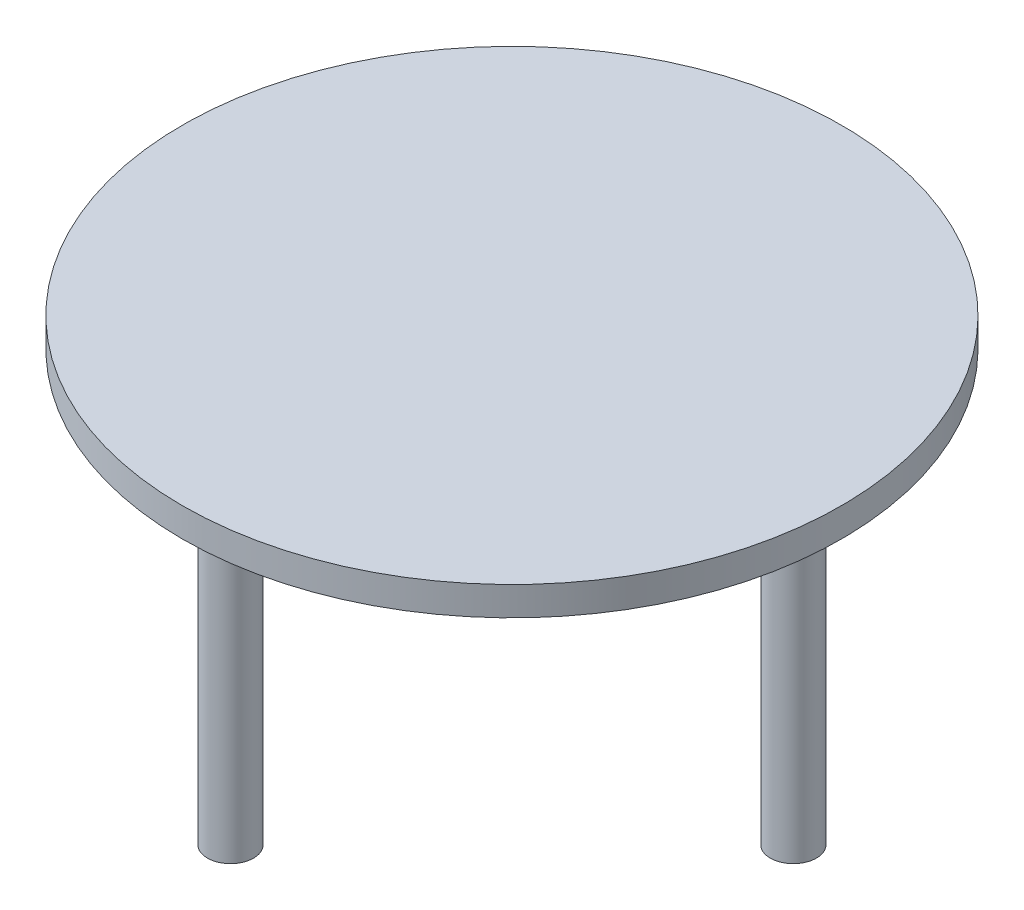
ISO-10303-21;
HEADER;
FILE_DESCRIPTION(('STEP AP214'),'2;1');
FILE_NAME('part.step','',(''),(''),'','','');
FILE_SCHEMA(('AUTOMOTIVE_DESIGN { 1 0 10303 214 1 1 1 1 }'));
ENDSEC;
DATA;
#1=APPLICATION_CONTEXT('core data for automotive mechanical design processes');
#2=APPLICATION_PROTOCOL_DEFINITION('international standard','automotive_design',2000,#1);
#3=PRODUCT_CONTEXT('',#1,'mechanical');
#4=PRODUCT('Part','Part','',(#3));
#5=PRODUCT_RELATED_PRODUCT_CATEGORY('part','',(#4));
#6=PRODUCT_DEFINITION_FORMATION('','',#4);
#7=PRODUCT_DEFINITION_CONTEXT('part definition',#1,'design');
#8=PRODUCT_DEFINITION('design','',#6,#7);
#9=PRODUCT_DEFINITION_SHAPE('','',#8);
#10=(LENGTH_UNIT() NAMED_UNIT(*) SI_UNIT(.MILLI.,.METRE.));
#11=(NAMED_UNIT(*) PLANE_ANGLE_UNIT() SI_UNIT($,.RADIAN.));
#12=(NAMED_UNIT(*) SI_UNIT($,.STERADIAN.) SOLID_ANGLE_UNIT());
#13=UNCERTAINTY_MEASURE_WITH_UNIT(LENGTH_MEASURE(1.E-05),#10,'distance_accuracy_value','');
#14=(GEOMETRIC_REPRESENTATION_CONTEXT(3) GLOBAL_UNCERTAINTY_ASSIGNED_CONTEXT((#13)) GLOBAL_UNIT_ASSIGNED_CONTEXT((#10,
#11,#12)) REPRESENTATION_CONTEXT('',''));
#15=CARTESIAN_POINT('',(0.,0.,0.));
#16=DIRECTION('',(0.,0.,1.));
#17=DIRECTION('',(1.,0.,0.));
#18=AXIS2_PLACEMENT_3D('',#15,#16,#17);
#19=CARTESIAN_POINT('',(0.,3.,0.));
#20=DIRECTION('',(0.,-1.,0.));
#21=DIRECTION('',(0.,0.,-1.));
#22=AXIS2_PLACEMENT_3D('',#19,#20,#21);
#23=CYLINDRICAL_SURFACE('',#22,34.2244145917749);
#24=CARTESIAN_POINT('',(0.,3.,0.));
#25=DIRECTION('',(0.,1.,0.));
#26=DIRECTION('',(0.,0.,1.));
#27=AXIS2_PLACEMENT_3D('',#24,#25,#26);
#28=CIRCLE('',#27,34.2244145917749);
#29=CARTESIAN_POINT('',(0.,3.,34.2244145917749));
#30=VERTEX_POINT('',#29);
#31=EDGE_CURVE('E10',#30,#30,#28,.T.);
#32=ORIENTED_EDGE('',*,*,#31,.F.);
#33=EDGE_LOOP('',(#32));
#34=FACE_BOUND('',#33,.T.);
#35=CARTESIAN_POINT('',(0.,0.,0.));
#36=DIRECTION('',(0.,1.,0.));
#37=DIRECTION('',(0.,0.,1.));
#38=AXIS2_PLACEMENT_3D('',#35,#36,#37);
#39=CIRCLE('',#38,34.2244145917749);
#40=CARTESIAN_POINT('',(0.,0.,34.2244145917749));
#41=VERTEX_POINT('',#40);
#42=EDGE_CURVE('E35',#41,#41,#39,.T.);
#43=ORIENTED_EDGE('',*,*,#42,.T.);
#44=EDGE_LOOP('',(#43));
#45=FACE_BOUND('',#44,.T.);
#46=ADVANCED_FACE('F32',(#34,#45),#23,.T.);
#47=CARTESIAN_POINT('',(0.,3.,0.));
#48=DIRECTION('',(0.,1.,0.));
#49=DIRECTION('',(0.,0.,1.));
#50=AXIS2_PLACEMENT_3D('',#47,#48,#49);
#51=PLANE('',#50);
#52=ORIENTED_EDGE('',*,*,#31,.T.);
#53=EDGE_LOOP('',(#52));
#54=FACE_BOUND('',#53,.T.);
#55=ADVANCED_FACE('F80',(#54),#51,.T.);
#56=CARTESIAN_POINT('',(0.,0.,0.));
#57=DIRECTION('',(0.,1.,0.));
#58=DIRECTION('',(0.,0.,1.));
#59=AXIS2_PLACEMENT_3D('',#56,#57,#58);
#60=PLANE('',#59);
#61=CARTESIAN_POINT('',(29.2244145917749,0.,0.));
#62=DIRECTION('',(0.,1.,0.));
#63=DIRECTION('',(0.,0.,1.));
#64=AXIS2_PLACEMENT_3D('',#61,#62,#63);
#65=CIRCLE('',#64,2.39651267844119);
#66=CARTESIAN_POINT('',(29.2244145917749,0.,2.39651267844119));
#67=VERTEX_POINT('',#66);
#68=EDGE_CURVE('E62',#67,#67,#65,.T.);
#69=ORIENTED_EDGE('',*,*,#68,.T.);
#70=EDGE_LOOP('',(#69));
#71=FACE_BOUND('',#70,.T.);
#72=CARTESIAN_POINT('',(0.,0.,-29.2244145917749));
#73=DIRECTION('',(0.,1.,0.));
#74=DIRECTION('',(0.,0.,1.));
#75=AXIS2_PLACEMENT_3D('',#72,#73,#74);
#76=CIRCLE('',#75,2.39651267844118);
#77=CARTESIAN_POINT('',(0.,0.,-26.8279019133337));
#78=VERTEX_POINT('',#77);
#79=EDGE_CURVE('E56',#78,#78,#76,.T.);
#80=ORIENTED_EDGE('',*,*,#79,.T.);
#81=EDGE_LOOP('',(#80));
#82=FACE_BOUND('',#81,.T.);
#83=CARTESIAN_POINT('',(0.,0.,29.2244145917749));
#84=DIRECTION('',(0.,1.,0.));
#85=DIRECTION('',(0.,0.,1.));
#86=AXIS2_PLACEMENT_3D('',#83,#84,#85);
#87=CIRCLE('',#86,2.39651267844118);
#88=CARTESIAN_POINT('',(0.,0.,31.6209272702161));
#89=VERTEX_POINT('',#88);
#90=EDGE_CURVE('E50',#89,#89,#87,.T.);
#91=ORIENTED_EDGE('',*,*,#90,.T.);
#92=EDGE_LOOP('',(#91));
#93=FACE_BOUND('',#92,.T.);
#94=CARTESIAN_POINT('',(-29.2244145917749,0.,0.));
#95=DIRECTION('',(0.,1.,0.));
#96=DIRECTION('',(0.,0.,1.));
#97=AXIS2_PLACEMENT_3D('',#94,#95,#96);
#98=CIRCLE('',#97,2.39651267844118);
#99=CARTESIAN_POINT('',(-29.2244145917749,0.,2.39651267844118));
#100=VERTEX_POINT('',#99);
#101=EDGE_CURVE('E44',#100,#100,#98,.T.);
#102=ORIENTED_EDGE('',*,*,#101,.T.);
#103=EDGE_LOOP('',(#102));
#104=FACE_BOUND('',#103,.T.);
#105=ORIENTED_EDGE('',*,*,#42,.F.);
#106=EDGE_LOOP('',(#105));
#107=FACE_BOUND('',#106,.T.);
#108=ADVANCED_FACE('F85',(#71,#82,#93,#104,#107),#60,.F.);
#109=CARTESIAN_POINT('',(-29.2244145917749,-30.,0.));
#110=DIRECTION('',(0.,1.,0.));
#111=DIRECTION('',(0.,0.,1.));
#112=AXIS2_PLACEMENT_3D('',#109,#110,#111);
#113=CYLINDRICAL_SURFACE('',#112,2.39651267844118);
#114=CARTESIAN_POINT('',(-29.2244145917749,-30.,0.));
#115=DIRECTION('',(0.,1.,0.));
#116=DIRECTION('',(0.,0.,1.));
#117=AXIS2_PLACEMENT_3D('',#114,#115,#116);
#118=CIRCLE('',#117,2.39651267844118);
#119=CARTESIAN_POINT('',(-29.2244145917749,-30.,2.39651267844118));
#120=VERTEX_POINT('',#119);
#121=EDGE_CURVE('E42',#120,#120,#118,.T.);
#122=ORIENTED_EDGE('',*,*,#121,.T.);
#123=EDGE_LOOP('',(#122));
#124=FACE_BOUND('',#123,.T.);
#125=ORIENTED_EDGE('',*,*,#101,.F.);
#126=EDGE_LOOP('',(#125));
#127=FACE_BOUND('',#126,.T.);
#128=ADVANCED_FACE('F91',(#124,#127),#113,.T.);
#129=CARTESIAN_POINT('',(0.,-30.,0.));
#130=DIRECTION('',(0.,1.,0.));
#131=DIRECTION('',(0.,0.,1.));
#132=AXIS2_PLACEMENT_3D('',#129,#130,#131);
#133=PLANE('',#132);
#134=ORIENTED_EDGE('',*,*,#121,.F.);
#135=EDGE_LOOP('',(#134));
#136=FACE_BOUND('',#135,.T.);
#137=ADVANCED_FACE('F96',(#136),#133,.F.);
#138=CARTESIAN_POINT('',(0.,-30.,29.2244145917749));
#139=DIRECTION('',(0.,1.,0.));
#140=DIRECTION('',(0.,0.,1.));
#141=AXIS2_PLACEMENT_3D('',#138,#139,#140);
#142=CYLINDRICAL_SURFACE('',#141,2.39651267844118);
#143=CARTESIAN_POINT('',(0.,-30.,29.2244145917749));
#144=DIRECTION('',(0.,1.,0.));
#145=DIRECTION('',(0.,0.,1.));
#146=AXIS2_PLACEMENT_3D('',#143,#144,#145);
#147=CIRCLE('',#146,2.39651267844118);
#148=CARTESIAN_POINT('',(0.,-30.,31.6209272702161));
#149=VERTEX_POINT('',#148);
#150=EDGE_CURVE('E47',#149,#149,#147,.T.);
#151=ORIENTED_EDGE('',*,*,#150,.T.);
#152=EDGE_LOOP('',(#151));
#153=FACE_BOUND('',#152,.T.);
#154=ORIENTED_EDGE('',*,*,#90,.F.);
#155=EDGE_LOOP('',(#154));
#156=FACE_BOUND('',#155,.T.);
#157=ADVANCED_FACE('F103',(#153,#156),#142,.T.);
#158=CARTESIAN_POINT('',(0.,-30.,0.));
#159=DIRECTION('',(0.,1.,0.));
#160=DIRECTION('',(0.,0.,1.));
#161=AXIS2_PLACEMENT_3D('',#158,#159,#160);
#162=PLANE('',#161);
#163=ORIENTED_EDGE('',*,*,#150,.F.);
#164=EDGE_LOOP('',(#163));
#165=FACE_BOUND('',#164,.T.);
#166=ADVANCED_FACE('F107',(#165),#162,.F.);
#167=CARTESIAN_POINT('',(0.,-30.,-29.2244145917749));
#168=DIRECTION('',(0.,1.,0.));
#169=DIRECTION('',(0.,0.,1.));
#170=AXIS2_PLACEMENT_3D('',#167,#168,#169);
#171=CYLINDRICAL_SURFACE('',#170,2.39651267844118);
#172=CARTESIAN_POINT('',(0.,-30.,-29.2244145917749));
#173=DIRECTION('',(0.,1.,0.));
#174=DIRECTION('',(0.,0.,1.));
#175=AXIS2_PLACEMENT_3D('',#172,#173,#174);
#176=CIRCLE('',#175,2.39651267844118);
#177=CARTESIAN_POINT('',(0.,-30.,-26.8279019133337));
#178=VERTEX_POINT('',#177);
#179=EDGE_CURVE('E53',#178,#178,#176,.T.);
#180=ORIENTED_EDGE('',*,*,#179,.T.);
#181=EDGE_LOOP('',(#180));
#182=FACE_BOUND('',#181,.T.);
#183=ORIENTED_EDGE('',*,*,#79,.F.);
#184=EDGE_LOOP('',(#183));
#185=FACE_BOUND('',#184,.T.);
#186=ADVANCED_FACE('F111',(#182,#185),#171,.T.);
#187=CARTESIAN_POINT('',(0.,-30.,0.));
#188=DIRECTION('',(0.,1.,0.));
#189=DIRECTION('',(0.,0.,1.));
#190=AXIS2_PLACEMENT_3D('',#187,#188,#189);
#191=PLANE('',#190);
#192=ORIENTED_EDGE('',*,*,#179,.F.);
#193=EDGE_LOOP('',(#192));
#194=FACE_BOUND('',#193,.T.);
#195=ADVANCED_FACE('F77',(#194),#191,.F.);
#196=CARTESIAN_POINT('',(29.2244145917749,-30.,0.));
#197=DIRECTION('',(0.,1.,0.));
#198=DIRECTION('',(0.,0.,1.));
#199=AXIS2_PLACEMENT_3D('',#196,#197,#198);
#200=CYLINDRICAL_SURFACE('',#199,2.39651267844119);
#201=CARTESIAN_POINT('',(29.2244145917749,-30.,0.));
#202=DIRECTION('',(0.,1.,0.));
#203=DIRECTION('',(0.,0.,1.));
#204=AXIS2_PLACEMENT_3D('',#201,#202,#203);
#205=CIRCLE('',#204,2.39651267844119);
#206=CARTESIAN_POINT('',(29.2244145917749,-30.,2.39651267844119));
#207=VERTEX_POINT('',#206);
#208=EDGE_CURVE('E59',#207,#207,#205,.T.);
#209=ORIENTED_EDGE('',*,*,#208,.T.);
#210=EDGE_LOOP('',(#209));
#211=FACE_BOUND('',#210,.T.);
#212=ORIENTED_EDGE('',*,*,#68,.F.);
#213=EDGE_LOOP('',(#212));
#214=FACE_BOUND('',#213,.T.);
#215=ADVANCED_FACE('F68',(#211,#214),#200,.T.);
#216=CARTESIAN_POINT('',(0.,-30.,0.));
#217=DIRECTION('',(0.,1.,0.));
#218=DIRECTION('',(0.,0.,1.));
#219=AXIS2_PLACEMENT_3D('',#216,#217,#218);
#220=PLANE('',#219);
#221=ORIENTED_EDGE('',*,*,#208,.F.);
#222=EDGE_LOOP('',(#221));
#223=FACE_BOUND('',#222,.T.);
#224=ADVANCED_FACE('F71',(#223),#220,.F.);
#225=CLOSED_SHELL('',(#46,#55,#108,#128,#137,#157,#166,#186,#195,#215,#224));
#226=MANIFOLD_SOLID_BREP('B2',#225);
#227=ADVANCED_BREP_SHAPE_REPRESENTATION('',(#18,#226),#14);
#228=SHAPE_DEFINITION_REPRESENTATION(#9,#227);
ENDSEC;
END-ISO-10303-21;
